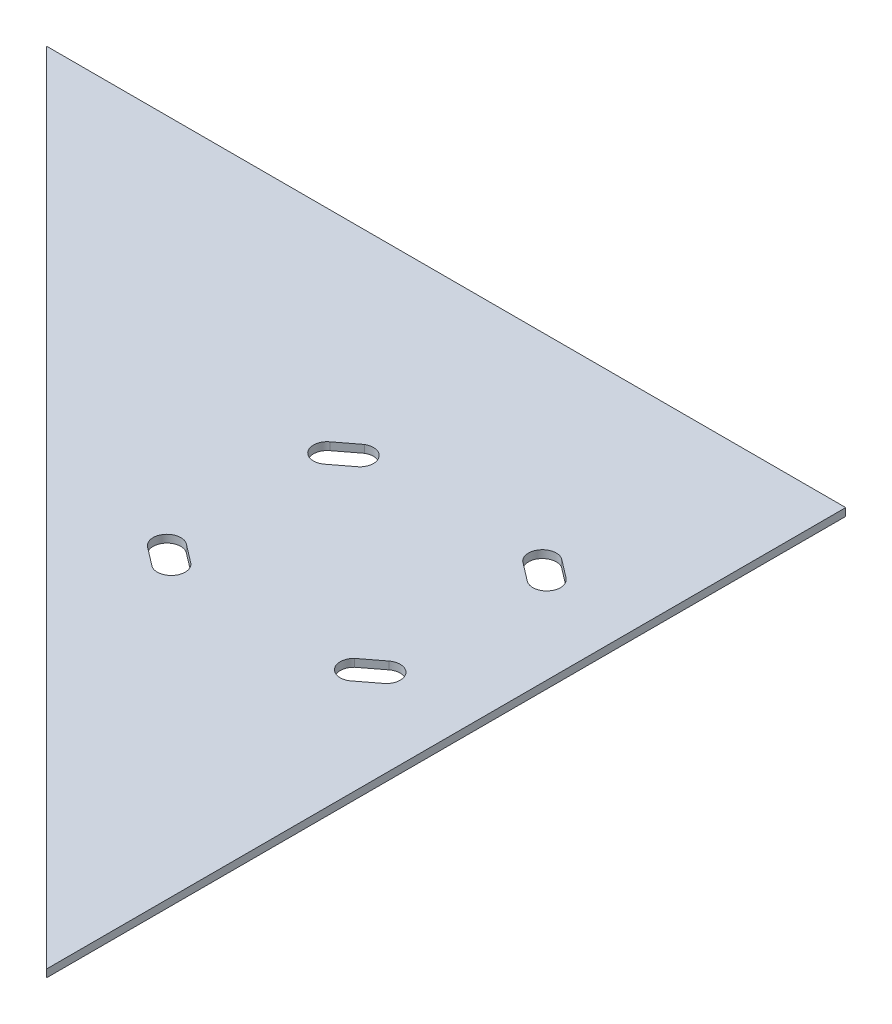
ISO-10303-21;
HEADER;
FILE_DESCRIPTION(('STEP AP214'),'2;1');
FILE_NAME('part.step','',(''),(''),'','','');
FILE_SCHEMA(('AUTOMOTIVE_DESIGN { 1 0 10303 214 1 1 1 1 }'));
ENDSEC;
DATA;
#1=APPLICATION_CONTEXT('core data for automotive mechanical design processes');
#2=APPLICATION_PROTOCOL_DEFINITION('international standard','automotive_design',2000,#1);
#3=PRODUCT_CONTEXT('',#1,'mechanical');
#4=PRODUCT('Part','Part','',(#3));
#5=PRODUCT_RELATED_PRODUCT_CATEGORY('part','',(#4));
#6=PRODUCT_DEFINITION_FORMATION('','',#4);
#7=PRODUCT_DEFINITION_CONTEXT('part definition',#1,'design');
#8=PRODUCT_DEFINITION('design','',#6,#7);
#9=PRODUCT_DEFINITION_SHAPE('','',#8);
#10=(LENGTH_UNIT() NAMED_UNIT(*) SI_UNIT(.MILLI.,.METRE.));
#11=(NAMED_UNIT(*) PLANE_ANGLE_UNIT() SI_UNIT($,.RADIAN.));
#12=(NAMED_UNIT(*) SI_UNIT($,.STERADIAN.) SOLID_ANGLE_UNIT());
#13=UNCERTAINTY_MEASURE_WITH_UNIT(LENGTH_MEASURE(1.E-05),#10,'distance_accuracy_value','');
#14=(GEOMETRIC_REPRESENTATION_CONTEXT(3) GLOBAL_UNCERTAINTY_ASSIGNED_CONTEXT((#13)) GLOBAL_UNIT_ASSIGNED_CONTEXT((#10,
#11,#12)) REPRESENTATION_CONTEXT('',''));
#15=CARTESIAN_POINT('',(0.,0.,0.));
#16=DIRECTION('',(0.,0.,1.));
#17=DIRECTION('',(1.,0.,0.));
#18=AXIS2_PLACEMENT_3D('',#15,#16,#17);
#19=CARTESIAN_POINT('',(36.1671450503566,3.175,47.2954973735433));
#20=DIRECTION('',(0.607450107570797,0.,0.794357832977196));
#21=DIRECTION('',(0.794357832977196,0.,-0.607450107570797));
#22=AXIS2_PLACEMENT_3D('',#19,#20,#21);
#23=PLANE('',#22);
#24=DIRECTION('',(-0.794357832977196,0.,0.607450107570797));
#25=VECTOR('',#24,1.);
#26=CARTESIAN_POINT('',(36.1671450503566,0.,47.2954973735433));
#27=LINE('',#26,#25);
#28=CARTESIAN_POINT('',(48.7819151562913,0.,37.648908469005));
#29=VERTEX_POINT('',#28);
#30=CARTESIAN_POINT('',(40.711239573243,0.,43.8206015619243));
#31=VERTEX_POINT('',#30);
#32=EDGE_CURVE('E241',#29,#31,#27,.T.);
#33=ORIENTED_EDGE('',*,*,#32,.T.);
#34=DIRECTION('',(0.,-1.,0.));
#35=VECTOR('',#34,1.);
#36=CARTESIAN_POINT('',(40.711239573243,3.175,43.8206015619243));
#37=LINE('',#36,#35);
#38=CARTESIAN_POINT('',(40.711239573243,3.175,43.8206015619243));
#39=VERTEX_POINT('',#38);
#40=EDGE_CURVE('E11',#39,#31,#37,.T.);
#41=ORIENTED_EDGE('',*,*,#40,.F.);
#42=DIRECTION('',(-0.794357832977196,0.,0.607450107570797));
#43=VECTOR('',#42,1.);
#44=CARTESIAN_POINT('',(36.1671450503566,3.175,47.2954973735433));
#45=LINE('',#44,#43);
#46=CARTESIAN_POINT('',(48.7819151562913,3.175,37.648908469005));
#47=VERTEX_POINT('',#46);
#48=EDGE_CURVE('E179',#47,#39,#45,.T.);
#49=ORIENTED_EDGE('',*,*,#48,.F.);
#50=DIRECTION('',(0.,-1.,0.));
#51=VECTOR('',#50,1.);
#52=CARTESIAN_POINT('',(48.7819151562913,3.175,37.648908469005));
#53=LINE('',#52,#51);
#54=EDGE_CURVE('E53',#47,#29,#53,.T.);
#55=ORIENTED_EDGE('',*,*,#54,.T.);
#56=EDGE_LOOP('',(#33,#41,#49,#55));
#57=FACE_BOUND('',#56,.T.);
#58=ADVANCED_FACE('F34',(#57),#23,.F.);
#59=CARTESIAN_POINT('',(37.7756055089127,3.175,38.8710075520079));
#60=DIRECTION('',(0.,-1.,0.));
#61=DIRECTION('',(0.,0.,-1.));
#62=AXIS2_PLACEMENT_3D('',#59,#60,#61);
#63=CYLINDRICAL_SURFACE('',#62,5.75468750000002);
#64=CARTESIAN_POINT('',(37.7756055089127,0.,38.8710075520079));
#65=DIRECTION('',(0.,1.,0.));
#66=DIRECTION('',(0.,0.,1.));
#67=AXIS2_PLACEMENT_3D('',#64,#65,#66);
#68=CIRCLE('',#67,5.75468750000002);
#69=CARTESIAN_POINT('',(33.7680848437087,0.,34.7410915309949));
#70=VERTEX_POINT('',#69);
#71=EDGE_CURVE('E185',#31,#70,#68,.F.);
#72=ORIENTED_EDGE('',*,*,#71,.T.);
#73=DIRECTION('',(0.,-1.,0.));
#74=VECTOR('',#73,1.);
#75=CARTESIAN_POINT('',(33.7680848437087,3.175,34.7410915309949));
#76=LINE('',#75,#74);
#77=CARTESIAN_POINT('',(33.7680848437087,3.175,34.7410915309949));
#78=VERTEX_POINT('',#77);
#79=EDGE_CURVE('E44',#78,#70,#76,.T.);
#80=ORIENTED_EDGE('',*,*,#79,.F.);
#81=CARTESIAN_POINT('',(37.7756055089127,3.175,38.8710075520079));
#82=DIRECTION('',(0.,1.,0.));
#83=DIRECTION('',(0.,0.,1.));
#84=AXIS2_PLACEMENT_3D('',#81,#82,#83);
#85=CIRCLE('',#84,5.75468750000002);
#86=EDGE_CURVE('E173',#39,#78,#85,.F.);
#87=ORIENTED_EDGE('',*,*,#86,.F.);
#88=ORIENTED_EDGE('',*,*,#40,.T.);
#89=EDGE_LOOP('',(#72,#80,#87,#88));
#90=FACE_BOUND('',#89,.T.);
#91=ADVANCED_FACE('F184',(#90),#63,.F.);
#92=CARTESIAN_POINT('',(29.2239903208225,3.175,38.2159873426139));
#93=DIRECTION('',(-0.607450107570799,0.,-0.794357832977195));
#94=DIRECTION('',(-0.794357832977195,0.,0.607450107570799));
#95=AXIS2_PLACEMENT_3D('',#92,#93,#94);
#96=PLANE('',#95);
#97=DIRECTION('',(0.794357832977195,0.,-0.607450107570799));
#98=VECTOR('',#97,1.);
#99=CARTESIAN_POINT('',(29.2239903208225,0.,38.2159873426139));
#100=LINE('',#99,#98);
#101=CARTESIAN_POINT('',(41.838760426757,0.,28.5693984380756));
#102=VERTEX_POINT('',#101);
#103=EDGE_CURVE('E244',#70,#102,#100,.T.);
#104=ORIENTED_EDGE('',*,*,#103,.T.);
#105=DIRECTION('',(0.,-1.,0.));
#106=VECTOR('',#105,1.);
#107=CARTESIAN_POINT('',(41.838760426757,3.175,28.5693984380756));
#108=LINE('',#107,#106);
#109=CARTESIAN_POINT('',(41.838760426757,3.175,28.5693984380756));
#110=VERTEX_POINT('',#109);
#111=EDGE_CURVE('E113',#110,#102,#108,.T.);
#112=ORIENTED_EDGE('',*,*,#111,.F.);
#113=DIRECTION('',(0.794357832977195,0.,-0.607450107570799));
#114=VECTOR('',#113,1.);
#115=CARTESIAN_POINT('',(29.2239903208225,3.175,38.2159873426139));
#116=LINE('',#115,#114);
#117=EDGE_CURVE('E178',#78,#110,#116,.T.);
#118=ORIENTED_EDGE('',*,*,#117,.F.);
#119=ORIENTED_EDGE('',*,*,#79,.T.);
#120=EDGE_LOOP('',(#104,#112,#118,#119));
#121=FACE_BOUND('',#120,.T.);
#122=ADVANCED_FACE('F189',(#121),#96,.F.);
#123=CARTESIAN_POINT('',(37.7756055089127,3.175,-38.8710075520079));
#124=DIRECTION('',(0.,-1.,0.));
#125=DIRECTION('',(0.,0.,-1.));
#126=AXIS2_PLACEMENT_3D('',#123,#124,#125);
#127=CYLINDRICAL_SURFACE('',#126,5.75468750000002);
#128=CARTESIAN_POINT('',(37.7756055089127,0.,-38.8710075520079));
#129=DIRECTION('',(0.,1.,0.));
#130=DIRECTION('',(0.,0.,1.));
#131=AXIS2_PLACEMENT_3D('',#128,#129,#130);
#132=CIRCLE('',#131,5.75468750000002);
#133=CARTESIAN_POINT('',(40.711239573243,0.,-43.8206015619243));
#134=VERTEX_POINT('',#133);
#135=CARTESIAN_POINT('',(33.7680848437087,0.,-34.7410915309949));
#136=VERTEX_POINT('',#135);
#137=EDGE_CURVE('E229',#134,#136,#132,.T.);
#138=ORIENTED_EDGE('',*,*,#137,.F.);
#139=DIRECTION('',(0.,-1.,0.));
#140=VECTOR('',#139,1.);
#141=CARTESIAN_POINT('',(40.711239573243,3.175,-43.8206015619243));
#142=LINE('',#141,#140);
#143=CARTESIAN_POINT('',(40.711239573243,3.175,-43.8206015619243));
#144=VERTEX_POINT('',#143);
#145=EDGE_CURVE('E251',#144,#134,#142,.T.);
#146=ORIENTED_EDGE('',*,*,#145,.F.);
#147=CARTESIAN_POINT('',(37.7756055089127,3.175,-38.8710075520079));
#148=DIRECTION('',(0.,1.,0.));
#149=DIRECTION('',(0.,0.,1.));
#150=AXIS2_PLACEMENT_3D('',#147,#148,#149);
#151=CIRCLE('',#150,5.75468750000002);
#152=CARTESIAN_POINT('',(33.7680848437087,3.175,-34.7410915309949));
#153=VERTEX_POINT('',#152);
#154=EDGE_CURVE('E325',#144,#153,#151,.T.);
#155=ORIENTED_EDGE('',*,*,#154,.T.);
#156=DIRECTION('',(0.,-1.,0.));
#157=VECTOR('',#156,1.);
#158=CARTESIAN_POINT('',(33.7680848437087,3.175,-34.7410915309949));
#159=LINE('',#158,#157);
#160=EDGE_CURVE('E253',#153,#136,#159,.T.);
#161=ORIENTED_EDGE('',*,*,#160,.T.);
#162=EDGE_LOOP('',(#138,#146,#155,#161));
#163=FACE_BOUND('',#162,.T.);
#164=ADVANCED_FACE('F352',(#163),#127,.F.);
#165=CARTESIAN_POINT('',(36.1671450503566,3.175,-47.2954973735433));
#166=DIRECTION('',(-0.607450107570797,0.,0.794357832977196));
#167=DIRECTION('',(0.794357832977196,0.,0.607450107570797));
#168=AXIS2_PLACEMENT_3D('',#165,#166,#167);
#169=PLANE('',#168);
#170=DIRECTION('',(-0.794357832977196,0.,-0.607450107570797));
#171=VECTOR('',#170,1.);
#172=CARTESIAN_POINT('',(36.1671450503566,0.,-47.2954973735433));
#173=LINE('',#172,#171);
#174=CARTESIAN_POINT('',(48.7819151562913,0.,-37.648908469005));
#175=VERTEX_POINT('',#174);
#176=EDGE_CURVE('E232',#175,#134,#173,.T.);
#177=ORIENTED_EDGE('',*,*,#176,.F.);
#178=DIRECTION('',(0.,-1.,0.));
#179=VECTOR('',#178,1.);
#180=CARTESIAN_POINT('',(48.7819151562913,3.175,-37.648908469005));
#181=LINE('',#180,#179);
#182=CARTESIAN_POINT('',(48.7819151562913,3.175,-37.648908469005));
#183=VERTEX_POINT('',#182);
#184=EDGE_CURVE('E258',#183,#175,#181,.T.);
#185=ORIENTED_EDGE('',*,*,#184,.F.);
#186=DIRECTION('',(-0.794357832977196,0.,-0.607450107570797));
#187=VECTOR('',#186,1.);
#188=CARTESIAN_POINT('',(36.1671450503566,3.175,-47.2954973735433));
#189=LINE('',#188,#187);
#190=EDGE_CURVE('E328',#183,#144,#189,.T.);
#191=ORIENTED_EDGE('',*,*,#190,.T.);
#192=ORIENTED_EDGE('',*,*,#145,.T.);
#193=EDGE_LOOP('',(#177,#185,#191,#192));
#194=FACE_BOUND('',#193,.T.);
#195=ADVANCED_FACE('F354',(#194),#169,.T.);
#196=CARTESIAN_POINT('',(45.3103377915242,3.175,-33.1091534535403));
#197=DIRECTION('',(0.,-1.,0.));
#198=DIRECTION('',(0.,0.,-1.));
#199=AXIS2_PLACEMENT_3D('',#196,#197,#198);
#200=CYLINDRICAL_SURFACE('',#199,5.71500000000002);
#201=CARTESIAN_POINT('',(45.3103377915242,0.,-33.1091534535403));
#202=DIRECTION('',(0.,1.,0.));
#203=DIRECTION('',(0.,0.,1.));
#204=AXIS2_PLACEMENT_3D('',#201,#202,#203);
#205=CIRCLE('',#204,5.71500000000002);
#206=CARTESIAN_POINT('',(41.838760426757,0.,-28.5693984380756));
#207=VERTEX_POINT('',#206);
#208=EDGE_CURVE('E235',#175,#207,#205,.F.);
#209=ORIENTED_EDGE('',*,*,#208,.T.);
#210=DIRECTION('',(0.,-1.,0.));
#211=VECTOR('',#210,1.);
#212=CARTESIAN_POINT('',(41.838760426757,3.175,-28.5693984380756));
#213=LINE('',#212,#211);
#214=CARTESIAN_POINT('',(41.838760426757,3.175,-28.5693984380756));
#215=VERTEX_POINT('',#214);
#216=EDGE_CURVE('E255',#215,#207,#213,.T.);
#217=ORIENTED_EDGE('',*,*,#216,.F.);
#218=CARTESIAN_POINT('',(45.3103377915242,3.175,-33.1091534535403));
#219=DIRECTION('',(0.,1.,0.));
#220=DIRECTION('',(0.,0.,1.));
#221=AXIS2_PLACEMENT_3D('',#218,#219,#220);
#222=CIRCLE('',#221,5.71500000000002);
#223=EDGE_CURVE('E331',#183,#215,#222,.F.);
#224=ORIENTED_EDGE('',*,*,#223,.F.);
#225=ORIENTED_EDGE('',*,*,#184,.T.);
#226=EDGE_LOOP('',(#209,#217,#224,#225));
#227=FACE_BOUND('',#226,.T.);
#228=ADVANCED_FACE('F345',(#227),#200,.F.);
#229=CARTESIAN_POINT('',(-45.3103377915242,3.175,-33.1091534535403));
#230=DIRECTION('',(0.,-1.,0.));
#231=DIRECTION('',(0.,0.,-1.));
#232=AXIS2_PLACEMENT_3D('',#229,#230,#231);
#233=CYLINDRICAL_SURFACE('',#232,5.71500000000002);
#234=CARTESIAN_POINT('',(-45.3103377915242,0.,-33.1091534535403));
#235=DIRECTION('',(0.,1.,0.));
#236=DIRECTION('',(0.,0.,1.));
#237=AXIS2_PLACEMENT_3D('',#234,#235,#236);
#238=CIRCLE('',#237,5.71500000000002);
#239=CARTESIAN_POINT('',(-48.7819151562913,0.,-37.648908469005));
#240=VERTEX_POINT('',#239);
#241=CARTESIAN_POINT('',(-41.838760426757,0.,-28.5693984380756));
#242=VERTEX_POINT('',#241);
#243=EDGE_CURVE('E217',#240,#242,#238,.T.);
#244=ORIENTED_EDGE('',*,*,#243,.F.);
#245=DIRECTION('',(0.,-1.,0.));
#246=VECTOR('',#245,1.);
#247=CARTESIAN_POINT('',(-48.7819151562913,3.175,-37.648908469005));
#248=LINE('',#247,#246);
#249=CARTESIAN_POINT('',(-48.7819151562913,3.175,-37.648908469005));
#250=VERTEX_POINT('',#249);
#251=EDGE_CURVE('E256',#250,#240,#248,.T.);
#252=ORIENTED_EDGE('',*,*,#251,.F.);
#253=CARTESIAN_POINT('',(-45.3103377915242,3.175,-33.1091534535403));
#254=DIRECTION('',(0.,1.,0.));
#255=DIRECTION('',(0.,0.,1.));
#256=AXIS2_PLACEMENT_3D('',#253,#254,#255);
#257=CIRCLE('',#256,5.71500000000002);
#258=CARTESIAN_POINT('',(-41.838760426757,3.175,-28.5693984380756));
#259=VERTEX_POINT('',#258);
#260=EDGE_CURVE('E314',#250,#259,#257,.T.);
#261=ORIENTED_EDGE('',*,*,#260,.T.);
#262=DIRECTION('',(0.,-1.,0.));
#263=VECTOR('',#262,1.);
#264=CARTESIAN_POINT('',(-41.838760426757,3.175,-28.5693984380756));
#265=LINE('',#264,#263);
#266=EDGE_CURVE('E261',#259,#242,#265,.T.);
#267=ORIENTED_EDGE('',*,*,#266,.T.);
#268=EDGE_LOOP('',(#244,#252,#261,#267));
#269=FACE_BOUND('',#268,.T.);
#270=ADVANCED_FACE('F361',(#269),#233,.F.);
#271=CARTESIAN_POINT('',(-36.1671450503567,3.175,-47.2954973735432));
#272=DIRECTION('',(-0.607450107570798,0.,-0.794357832977196));
#273=DIRECTION('',(-0.794357832977196,0.,0.607450107570798));
#274=AXIS2_PLACEMENT_3D('',#271,#272,#273);
#275=PLANE('',#274);
#276=DIRECTION('',(0.794357832977196,0.,-0.607450107570798));
#277=VECTOR('',#276,1.);
#278=CARTESIAN_POINT('',(-36.1671450503567,0.,-47.2954973735432));
#279=LINE('',#278,#277);
#280=CARTESIAN_POINT('',(-40.711239573243,0.,-43.8206015619243));
#281=VERTEX_POINT('',#280);
#282=EDGE_CURVE('E220',#240,#281,#279,.T.);
#283=ORIENTED_EDGE('',*,*,#282,.T.);
#284=DIRECTION('',(0.,-1.,0.));
#285=VECTOR('',#284,1.);
#286=CARTESIAN_POINT('',(-40.711239573243,3.175,-43.8206015619243));
#287=LINE('',#286,#285);
#288=CARTESIAN_POINT('',(-40.711239573243,3.175,-43.8206015619243));
#289=VERTEX_POINT('',#288);
#290=EDGE_CURVE('E267',#289,#281,#287,.T.);
#291=ORIENTED_EDGE('',*,*,#290,.F.);
#292=DIRECTION('',(0.794357832977196,0.,-0.607450107570798));
#293=VECTOR('',#292,1.);
#294=CARTESIAN_POINT('',(-36.1671450503567,3.175,-47.2954973735432));
#295=LINE('',#294,#293);
#296=EDGE_CURVE('E317',#250,#289,#295,.T.);
#297=ORIENTED_EDGE('',*,*,#296,.F.);
#298=ORIENTED_EDGE('',*,*,#251,.T.);
#299=EDGE_LOOP('',(#283,#291,#297,#298));
#300=FACE_BOUND('',#299,.T.);
#301=ADVANCED_FACE('F403',(#300),#275,.F.);
#302=CARTESIAN_POINT('',(-37.7756055089127,3.175,-38.8710075520079));
#303=DIRECTION('',(0.,-1.,0.));
#304=DIRECTION('',(0.,0.,-1.));
#305=AXIS2_PLACEMENT_3D('',#302,#303,#304);
#306=CYLINDRICAL_SURFACE('',#305,5.75468750000002);
#307=CARTESIAN_POINT('',(-37.7756055089127,0.,-38.8710075520079));
#308=DIRECTION('',(0.,1.,0.));
#309=DIRECTION('',(0.,0.,1.));
#310=AXIS2_PLACEMENT_3D('',#307,#308,#309);
#311=CIRCLE('',#310,5.75468750000002);
#312=CARTESIAN_POINT('',(-33.7680848437087,0.,-34.7410915309949));
#313=VERTEX_POINT('',#312);
#314=EDGE_CURVE('E223',#281,#313,#311,.F.);
#315=ORIENTED_EDGE('',*,*,#314,.T.);
#316=DIRECTION('',(0.,-1.,0.));
#317=VECTOR('',#316,1.);
#318=CARTESIAN_POINT('',(-33.7680848437087,3.175,-34.7410915309949));
#319=LINE('',#318,#317);
#320=CARTESIAN_POINT('',(-33.7680848437087,3.175,-34.7410915309949));
#321=VERTEX_POINT('',#320);
#322=EDGE_CURVE('E263',#321,#313,#319,.T.);
#323=ORIENTED_EDGE('',*,*,#322,.F.);
#324=CARTESIAN_POINT('',(-37.7756055089127,3.175,-38.8710075520079));
#325=DIRECTION('',(0.,1.,0.));
#326=DIRECTION('',(0.,0.,1.));
#327=AXIS2_PLACEMENT_3D('',#324,#325,#326);
#328=CIRCLE('',#327,5.75468750000002);
#329=EDGE_CURVE('E320',#289,#321,#328,.F.);
#330=ORIENTED_EDGE('',*,*,#329,.F.);
#331=ORIENTED_EDGE('',*,*,#290,.T.);
#332=EDGE_LOOP('',(#315,#323,#330,#331));
#333=FACE_BOUND('',#332,.T.);
#334=ADVANCED_FACE('F393',(#333),#306,.F.);
#335=CARTESIAN_POINT('',(-64.135,3.175,64.135));
#336=DIRECTION('',(-0.707106781186547,0.,0.707106781186548));
#337=DIRECTION('',(0.707106781186548,0.,0.707106781186547));
#338=AXIS2_PLACEMENT_3D('',#335,#336,#337);
#339=PLANE('',#338);
#340=DIRECTION('',(-0.707106781186548,0.,-0.707106781186547));
#341=VECTOR('',#340,1.);
#342=CARTESIAN_POINT('',(-64.135,0.,64.135));
#343=LINE('',#342,#341);
#344=CARTESIAN_POINT('',(81.28,0.,209.55));
#345=VERTEX_POINT('',#344);
#346=CARTESIAN_POINT('',(-248.92,0.,-120.65));
#347=VERTEX_POINT('',#346);
#348=EDGE_CURVE('E208',#345,#347,#343,.T.);
#349=ORIENTED_EDGE('',*,*,#348,.F.);
#350=DIRECTION('',(0.,-1.,0.));
#351=VECTOR('',#350,1.);
#352=CARTESIAN_POINT('',(81.28,3.175,209.55));
#353=LINE('',#352,#351);
#354=CARTESIAN_POINT('',(81.28,3.175,209.55));
#355=VERTEX_POINT('',#354);
#356=EDGE_CURVE('E264',#355,#345,#353,.T.);
#357=ORIENTED_EDGE('',*,*,#356,.F.);
#358=DIRECTION('',(-0.707106781186548,0.,-0.707106781186547));
#359=VECTOR('',#358,1.);
#360=CARTESIAN_POINT('',(-64.135,3.175,64.135));
#361=LINE('',#360,#359);
#362=CARTESIAN_POINT('',(-248.92,3.175,-120.65));
#363=VERTEX_POINT('',#362);
#364=EDGE_CURVE('E302',#355,#363,#361,.T.);
#365=ORIENTED_EDGE('',*,*,#364,.T.);
#366=DIRECTION('',(0.,-1.,0.));
#367=VECTOR('',#366,1.);
#368=CARTESIAN_POINT('',(-248.92,3.175,-120.65));
#369=LINE('',#368,#367);
#370=EDGE_CURVE('E271',#363,#347,#369,.T.);
#371=ORIENTED_EDGE('',*,*,#370,.T.);
#372=EDGE_LOOP('',(#349,#357,#365,#371));
#373=FACE_BOUND('',#372,.T.);
#374=ADVANCED_FACE('F389',(#373),#339,.T.);
#375=CARTESIAN_POINT('',(81.28,3.175,0.));
#376=DIRECTION('',(-1.,0.,0.));
#377=DIRECTION('',(0.,0.,1.));
#378=AXIS2_PLACEMENT_3D('',#375,#376,#377);
#379=PLANE('',#378);
#380=DIRECTION('',(0.,0.,-1.));
#381=VECTOR('',#380,1.);
#382=CARTESIAN_POINT('',(81.28,0.,0.));
#383=LINE('',#382,#381);
#384=CARTESIAN_POINT('',(81.28,0.,-120.65));
#385=VERTEX_POINT('',#384);
#386=EDGE_CURVE('E211',#345,#385,#383,.T.);
#387=ORIENTED_EDGE('',*,*,#386,.T.);
#388=DIRECTION('',(0.,-1.,0.));
#389=VECTOR('',#388,1.);
#390=CARTESIAN_POINT('',(81.28,3.175,-120.65));
#391=LINE('',#390,#389);
#392=CARTESIAN_POINT('',(81.28,3.175,-120.65));
#393=VERTEX_POINT('',#392);
#394=EDGE_CURVE('E273',#393,#385,#391,.T.);
#395=ORIENTED_EDGE('',*,*,#394,.F.);
#396=DIRECTION('',(0.,0.,-1.));
#397=VECTOR('',#396,1.);
#398=CARTESIAN_POINT('',(81.28,3.175,0.));
#399=LINE('',#398,#397);
#400=EDGE_CURVE('E305',#355,#393,#399,.T.);
#401=ORIENTED_EDGE('',*,*,#400,.F.);
#402=ORIENTED_EDGE('',*,*,#356,.T.);
#403=EDGE_LOOP('',(#387,#395,#401,#402));
#404=FACE_BOUND('',#403,.T.);
#405=ADVANCED_FACE('F392',(#404),#379,.F.);
#406=CARTESIAN_POINT('',(-37.7756055089126,3.175,38.8710075520079));
#407=DIRECTION('',(0.,-1.,0.));
#408=DIRECTION('',(0.,0.,-1.));
#409=AXIS2_PLACEMENT_3D('',#406,#407,#408);
#410=CYLINDRICAL_SURFACE('',#409,5.75468750000002);
#411=CARTESIAN_POINT('',(-37.7756055089126,0.,38.8710075520079));
#412=DIRECTION('',(0.,1.,0.));
#413=DIRECTION('',(0.,0.,1.));
#414=AXIS2_PLACEMENT_3D('',#411,#412,#413);
#415=CIRCLE('',#414,5.75468750000002);
#416=CARTESIAN_POINT('',(-40.7112395732429,0.,43.8206015619243));
#417=VERTEX_POINT('',#416);
#418=CARTESIAN_POINT('',(-33.7680848437087,0.,34.7410915309949));
#419=VERTEX_POINT('',#418);
#420=EDGE_CURVE('E196',#417,#419,#415,.T.);
#421=ORIENTED_EDGE('',*,*,#420,.F.);
#422=DIRECTION('',(0.,-1.,0.));
#423=VECTOR('',#422,1.);
#424=CARTESIAN_POINT('',(-40.7112395732429,3.175,43.8206015619243));
#425=LINE('',#424,#423);
#426=CARTESIAN_POINT('',(-40.7112395732429,3.175,43.8206015619243));
#427=VERTEX_POINT('',#426);
#428=EDGE_CURVE('E38',#427,#417,#425,.T.);
#429=ORIENTED_EDGE('',*,*,#428,.F.);
#430=CARTESIAN_POINT('',(-37.7756055089126,3.175,38.8710075520079));
#431=DIRECTION('',(0.,1.,0.));
#432=DIRECTION('',(0.,0.,1.));
#433=AXIS2_PLACEMENT_3D('',#430,#431,#432);
#434=CIRCLE('',#433,5.75468750000002);
#435=CARTESIAN_POINT('',(-33.7680848437087,3.175,34.7410915309949));
#436=VERTEX_POINT('',#435);
#437=EDGE_CURVE('E249',#427,#436,#434,.T.);
#438=ORIENTED_EDGE('',*,*,#437,.T.);
#439=DIRECTION('',(0.,-1.,0.));
#440=VECTOR('',#439,1.);
#441=CARTESIAN_POINT('',(-33.7680848437087,3.175,34.7410915309949));
#442=LINE('',#441,#440);
#443=EDGE_CURVE('E192',#436,#419,#442,.T.);
#444=ORIENTED_EDGE('',*,*,#443,.T.);
#445=EDGE_LOOP('',(#421,#429,#438,#444));
#446=FACE_BOUND('',#445,.T.);
#447=ADVANCED_FACE('F36',(#446),#410,.F.);
#448=CARTESIAN_POINT('',(-36.1671450503566,3.175,47.2954973735433));
#449=DIRECTION('',(0.607450107570797,0.,-0.794357832977196));
#450=DIRECTION('',(-0.794357832977197,0.,-0.607450107570797));
#451=AXIS2_PLACEMENT_3D('',#448,#449,#450);
#452=PLANE('',#451);
#453=DIRECTION('',(0.794357832977197,0.,0.607450107570797));
#454=VECTOR('',#453,1.);
#455=CARTESIAN_POINT('',(-36.1671450503566,0.,47.2954973735433));
#456=LINE('',#455,#454);
#457=CARTESIAN_POINT('',(-48.7819151562912,0.,37.648908469005));
#458=VERTEX_POINT('',#457);
#459=EDGE_CURVE('E199',#458,#417,#456,.T.);
#460=ORIENTED_EDGE('',*,*,#459,.F.);
#461=DIRECTION('',(0.,-1.,0.));
#462=VECTOR('',#461,1.);
#463=CARTESIAN_POINT('',(-48.7819151562912,3.175,37.648908469005));
#464=LINE('',#463,#462);
#465=CARTESIAN_POINT('',(-48.7819151562912,3.175,37.648908469005));
#466=VERTEX_POINT('',#465);
#467=EDGE_CURVE('E279',#466,#458,#464,.T.);
#468=ORIENTED_EDGE('',*,*,#467,.F.);
#469=DIRECTION('',(0.794357832977197,0.,0.607450107570797));
#470=VECTOR('',#469,1.);
#471=CARTESIAN_POINT('',(-36.1671450503566,3.175,47.2954973735433));
#472=LINE('',#471,#470);
#473=EDGE_CURVE('E288',#466,#427,#472,.T.);
#474=ORIENTED_EDGE('',*,*,#473,.T.);
#475=ORIENTED_EDGE('',*,*,#428,.T.);
#476=EDGE_LOOP('',(#460,#468,#474,#475));
#477=FACE_BOUND('',#476,.T.);
#478=ADVANCED_FACE('F286',(#477),#452,.T.);
#479=CARTESIAN_POINT('',(-45.3103377915242,3.175,33.1091534535403));
#480=DIRECTION('',(0.,-1.,0.));
#481=DIRECTION('',(0.,0.,-1.));
#482=AXIS2_PLACEMENT_3D('',#479,#480,#481);
#483=CYLINDRICAL_SURFACE('',#482,5.71500000000002);
#484=CARTESIAN_POINT('',(-45.3103377915242,0.,33.1091534535403));
#485=DIRECTION('',(0.,1.,0.));
#486=DIRECTION('',(0.,0.,1.));
#487=AXIS2_PLACEMENT_3D('',#484,#485,#486);
#488=CIRCLE('',#487,5.71500000000002);
#489=CARTESIAN_POINT('',(-41.838760426757,0.,28.5693984380756));
#490=VERTEX_POINT('',#489);
#491=EDGE_CURVE('E202',#458,#490,#488,.F.);
#492=ORIENTED_EDGE('',*,*,#491,.T.);
#493=DIRECTION('',(0.,-1.,0.));
#494=VECTOR('',#493,1.);
#495=CARTESIAN_POINT('',(-41.838760426757,3.175,28.5693984380756));
#496=LINE('',#495,#494);
#497=CARTESIAN_POINT('',(-41.838760426757,3.175,28.5693984380756));
#498=VERTEX_POINT('',#497);
#499=EDGE_CURVE('E278',#498,#490,#496,.T.);
#500=ORIENTED_EDGE('',*,*,#499,.F.);
#501=CARTESIAN_POINT('',(-45.3103377915242,3.175,33.1091534535403));
#502=DIRECTION('',(0.,1.,0.));
#503=DIRECTION('',(0.,0.,1.));
#504=AXIS2_PLACEMENT_3D('',#501,#502,#503);
#505=CIRCLE('',#504,5.71500000000002);
#506=EDGE_CURVE('E296',#466,#498,#505,.F.);
#507=ORIENTED_EDGE('',*,*,#506,.F.);
#508=ORIENTED_EDGE('',*,*,#467,.T.);
#509=EDGE_LOOP('',(#492,#500,#507,#508));
#510=FACE_BOUND('',#509,.T.);
#511=ADVANCED_FACE('F294',(#510),#483,.F.);
#512=CARTESIAN_POINT('',(29.2239903208225,3.175,-38.2159873426139));
#513=DIRECTION('',(0.607450107570799,0.,-0.794357832977195));
#514=DIRECTION('',(-0.794357832977195,0.,-0.607450107570799));
#515=AXIS2_PLACEMENT_3D('',#512,#513,#514);
#516=PLANE('',#515);
#517=DIRECTION('',(0.794357832977195,0.,0.607450107570799));
#518=VECTOR('',#517,1.);
#519=CARTESIAN_POINT('',(29.2239903208225,0.,-38.2159873426139));
#520=LINE('',#519,#518);
#521=EDGE_CURVE('E238',#136,#207,#520,.T.);
#522=ORIENTED_EDGE('',*,*,#521,.F.);
#523=ORIENTED_EDGE('',*,*,#160,.F.);
#524=DIRECTION('',(0.794357832977195,0.,0.607450107570799));
#525=VECTOR('',#524,1.);
#526=CARTESIAN_POINT('',(29.2239903208225,3.175,-38.2159873426139));
#527=LINE('',#526,#525);
#528=EDGE_CURVE('E333',#153,#215,#527,.T.);
#529=ORIENTED_EDGE('',*,*,#528,.T.);
#530=ORIENTED_EDGE('',*,*,#216,.T.);
#531=EDGE_LOOP('',(#522,#523,#529,#530));
#532=FACE_BOUND('',#531,.T.);
#533=ADVANCED_FACE('F338',(#532),#516,.T.);
#534=CARTESIAN_POINT('',(-29.2239903208225,3.175,-38.2159873426138));
#535=DIRECTION('',(0.607450107570799,0.,0.794357832977195));
#536=DIRECTION('',(0.794357832977195,0.,-0.607450107570799));
#537=AXIS2_PLACEMENT_3D('',#534,#535,#536);
#538=PLANE('',#537);
#539=DIRECTION('',(-0.794357832977195,0.,0.607450107570799));
#540=VECTOR('',#539,1.);
#541=CARTESIAN_POINT('',(-29.2239903208225,0.,-38.2159873426138));
#542=LINE('',#541,#540);
#543=EDGE_CURVE('E226',#313,#242,#542,.T.);
#544=ORIENTED_EDGE('',*,*,#543,.T.);
#545=ORIENTED_EDGE('',*,*,#266,.F.);
#546=DIRECTION('',(-0.794357832977195,0.,0.607450107570799));
#547=VECTOR('',#546,1.);
#548=CARTESIAN_POINT('',(-29.2239903208225,3.175,-38.2159873426138));
#549=LINE('',#548,#547);
#550=EDGE_CURVE('E323',#321,#259,#549,.T.);
#551=ORIENTED_EDGE('',*,*,#550,.F.);
#552=ORIENTED_EDGE('',*,*,#322,.T.);
#553=EDGE_LOOP('',(#544,#545,#551,#552));
#554=FACE_BOUND('',#553,.T.);
#555=ADVANCED_FACE('F373',(#554),#538,.F.);
#556=CARTESIAN_POINT('',(0.,3.175,-120.65));
#557=DIRECTION('',(0.,0.,1.));
#558=DIRECTION('',(1.,0.,0.));
#559=AXIS2_PLACEMENT_3D('',#556,#557,#558);
#560=PLANE('',#559);
#561=DIRECTION('',(-1.,0.,0.));
#562=VECTOR('',#561,1.);
#563=CARTESIAN_POINT('',(0.,0.,-120.65));
#564=LINE('',#563,#562);
#565=EDGE_CURVE('E214',#385,#347,#564,.T.);
#566=ORIENTED_EDGE('',*,*,#565,.T.);
#567=ORIENTED_EDGE('',*,*,#370,.F.);
#568=DIRECTION('',(-1.,0.,0.));
#569=VECTOR('',#568,1.);
#570=CARTESIAN_POINT('',(0.,3.175,-120.65));
#571=LINE('',#570,#569);
#572=EDGE_CURVE('E312',#393,#363,#571,.T.);
#573=ORIENTED_EDGE('',*,*,#572,.F.);
#574=ORIENTED_EDGE('',*,*,#394,.T.);
#575=EDGE_LOOP('',(#566,#567,#573,#574));
#576=FACE_BOUND('',#575,.T.);
#577=ADVANCED_FACE('F378',(#576),#560,.F.);
#578=CARTESIAN_POINT('',(-29.2239903208224,3.175,38.2159873426139));
#579=DIRECTION('',(-0.607450107570798,0.,0.794357832977196));
#580=DIRECTION('',(0.794357832977196,0.,0.607450107570798));
#581=AXIS2_PLACEMENT_3D('',#578,#579,#580);
#582=PLANE('',#581);
#583=DIRECTION('',(-0.794357832977196,0.,-0.607450107570798));
#584=VECTOR('',#583,1.);
#585=CARTESIAN_POINT('',(-29.2239903208224,0.,38.2159873426139));
#586=LINE('',#585,#584);
#587=EDGE_CURVE('E205',#419,#490,#586,.T.);
#588=ORIENTED_EDGE('',*,*,#587,.F.);
#589=ORIENTED_EDGE('',*,*,#443,.F.);
#590=DIRECTION('',(-0.794357832977196,0.,-0.607450107570798));
#591=VECTOR('',#590,1.);
#592=CARTESIAN_POINT('',(-29.2239903208224,3.175,38.2159873426139));
#593=LINE('',#592,#591);
#594=EDGE_CURVE('E299',#436,#498,#593,.T.);
#595=ORIENTED_EDGE('',*,*,#594,.T.);
#596=ORIENTED_EDGE('',*,*,#499,.T.);
#597=EDGE_LOOP('',(#588,#589,#595,#596));
#598=FACE_BOUND('',#597,.T.);
#599=ADVANCED_FACE('F300',(#598),#582,.T.);
#600=CARTESIAN_POINT('',(45.3103377915242,3.175,33.1091534535403));
#601=DIRECTION('',(0.,-1.,0.));
#602=DIRECTION('',(0.,0.,-1.));
#603=AXIS2_PLACEMENT_3D('',#600,#601,#602);
#604=CYLINDRICAL_SURFACE('',#603,5.71500000000002);
#605=CARTESIAN_POINT('',(45.3103377915242,0.,33.1091534535403));
#606=DIRECTION('',(0.,1.,0.));
#607=DIRECTION('',(0.,0.,1.));
#608=AXIS2_PLACEMENT_3D('',#605,#606,#607);
#609=CIRCLE('',#608,5.71500000000002);
#610=EDGE_CURVE('E246',#29,#102,#609,.T.);
#611=ORIENTED_EDGE('',*,*,#610,.F.);
#612=ORIENTED_EDGE('',*,*,#54,.F.);
#613=CARTESIAN_POINT('',(45.3103377915242,3.175,33.1091534535403));
#614=DIRECTION('',(0.,1.,0.));
#615=DIRECTION('',(0.,0.,1.));
#616=AXIS2_PLACEMENT_3D('',#613,#614,#615);
#617=CIRCLE('',#616,5.71500000000002);
#618=EDGE_CURVE('E190',#47,#110,#617,.T.);
#619=ORIENTED_EDGE('',*,*,#618,.T.);
#620=ORIENTED_EDGE('',*,*,#111,.T.);
#621=EDGE_LOOP('',(#611,#612,#619,#620));
#622=FACE_BOUND('',#621,.T.);
#623=ADVANCED_FACE('F388',(#622),#604,.F.);
#624=CARTESIAN_POINT('',(0.,3.175,0.));
#625=DIRECTION('',(0.,1.,0.));
#626=DIRECTION('',(0.,0.,1.));
#627=AXIS2_PLACEMENT_3D('',#624,#625,#626);
#628=PLANE('',#627);
#629=ORIENTED_EDGE('',*,*,#437,.F.);
#630=ORIENTED_EDGE('',*,*,#473,.F.);
#631=ORIENTED_EDGE('',*,*,#506,.T.);
#632=ORIENTED_EDGE('',*,*,#594,.F.);
#633=EDGE_LOOP('',(#629,#630,#631,#632));
#634=FACE_BOUND('',#633,.T.);
#635=ORIENTED_EDGE('',*,*,#364,.F.);
#636=ORIENTED_EDGE('',*,*,#400,.T.);
#637=ORIENTED_EDGE('',*,*,#572,.T.);
#638=EDGE_LOOP('',(#635,#636,#637));
#639=FACE_BOUND('',#638,.T.);
#640=ORIENTED_EDGE('',*,*,#260,.F.);
#641=ORIENTED_EDGE('',*,*,#296,.T.);
#642=ORIENTED_EDGE('',*,*,#329,.T.);
#643=ORIENTED_EDGE('',*,*,#550,.T.);
#644=EDGE_LOOP('',(#640,#641,#642,#643));
#645=FACE_BOUND('',#644,.T.);
#646=ORIENTED_EDGE('',*,*,#154,.F.);
#647=ORIENTED_EDGE('',*,*,#190,.F.);
#648=ORIENTED_EDGE('',*,*,#223,.T.);
#649=ORIENTED_EDGE('',*,*,#528,.F.);
#650=EDGE_LOOP('',(#646,#647,#648,#649));
#651=FACE_BOUND('',#650,.T.);
#652=ORIENTED_EDGE('',*,*,#48,.T.);
#653=ORIENTED_EDGE('',*,*,#86,.T.);
#654=ORIENTED_EDGE('',*,*,#117,.T.);
#655=ORIENTED_EDGE('',*,*,#618,.F.);
#656=EDGE_LOOP('',(#652,#653,#654,#655));
#657=FACE_BOUND('',#656,.T.);
#658=ADVANCED_FACE('F175',(#634,#639,#645,#651,#657),#628,.T.);
#659=CARTESIAN_POINT('',(0.,0.,0.));
#660=DIRECTION('',(0.,1.,0.));
#661=DIRECTION('',(0.,0.,1.));
#662=AXIS2_PLACEMENT_3D('',#659,#660,#661);
#663=PLANE('',#662);
#664=ORIENTED_EDGE('',*,*,#420,.T.);
#665=ORIENTED_EDGE('',*,*,#587,.T.);
#666=ORIENTED_EDGE('',*,*,#491,.F.);
#667=ORIENTED_EDGE('',*,*,#459,.T.);
#668=EDGE_LOOP('',(#664,#665,#666,#667));
#669=FACE_BOUND('',#668,.T.);
#670=ORIENTED_EDGE('',*,*,#348,.T.);
#671=ORIENTED_EDGE('',*,*,#565,.F.);
#672=ORIENTED_EDGE('',*,*,#386,.F.);
#673=EDGE_LOOP('',(#670,#671,#672));
#674=FACE_BOUND('',#673,.T.);
#675=ORIENTED_EDGE('',*,*,#243,.T.);
#676=ORIENTED_EDGE('',*,*,#543,.F.);
#677=ORIENTED_EDGE('',*,*,#314,.F.);
#678=ORIENTED_EDGE('',*,*,#282,.F.);
#679=EDGE_LOOP('',(#675,#676,#677,#678));
#680=FACE_BOUND('',#679,.T.);
#681=ORIENTED_EDGE('',*,*,#137,.T.);
#682=ORIENTED_EDGE('',*,*,#521,.T.);
#683=ORIENTED_EDGE('',*,*,#208,.F.);
#684=ORIENTED_EDGE('',*,*,#176,.T.);
#685=EDGE_LOOP('',(#681,#682,#683,#684));
#686=FACE_BOUND('',#685,.T.);
#687=ORIENTED_EDGE('',*,*,#32,.F.);
#688=ORIENTED_EDGE('',*,*,#610,.T.);
#689=ORIENTED_EDGE('',*,*,#103,.F.);
#690=ORIENTED_EDGE('',*,*,#71,.F.);
#691=EDGE_LOOP('',(#687,#688,#689,#690));
#692=FACE_BOUND('',#691,.T.);
#693=ADVANCED_FACE('F291',(#669,#674,#680,#686,#692),#663,.F.);
#694=CLOSED_SHELL('',(#58,#91,#122,#164,#195,#228,#270,#301,#334,#374,#405,#447,#478,#511,#533,
#555,#577,#599,#623,#658,#693));
#695=MANIFOLD_SOLID_BREP('B2',#694);
#696=ADVANCED_BREP_SHAPE_REPRESENTATION('',(#18,#695),#14);
#697=SHAPE_DEFINITION_REPRESENTATION(#9,#696);
ENDSEC;
END-ISO-10303-21;
